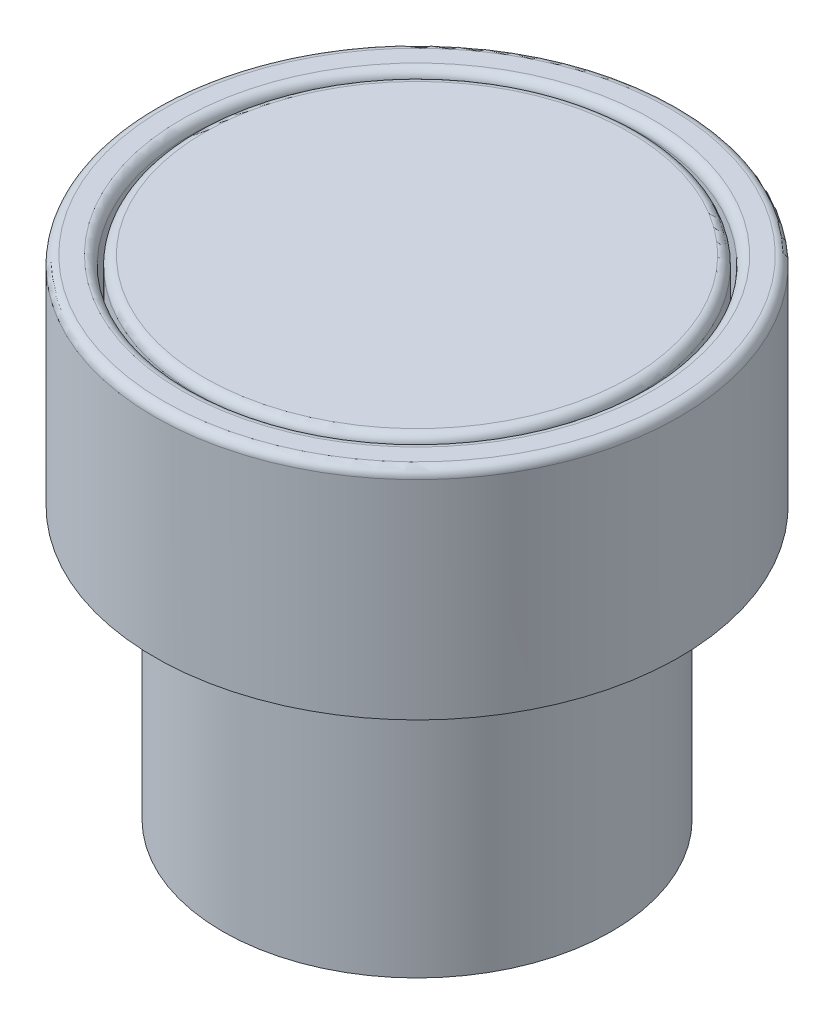
ISO-10303-21;
HEADER;
FILE_DESCRIPTION(('STEP AP214'),'2;1');
FILE_NAME('part.step','',(''),(''),'','','');
FILE_SCHEMA(('AUTOMOTIVE_DESIGN { 1 0 10303 214 1 1 1 1 }'));
ENDSEC;
DATA;
#1=APPLICATION_CONTEXT('core data for automotive mechanical design processes');
#2=APPLICATION_PROTOCOL_DEFINITION('international standard','automotive_design',2000,#1);
#3=PRODUCT_CONTEXT('',#1,'mechanical');
#4=PRODUCT('Part','Part','',(#3));
#5=PRODUCT_RELATED_PRODUCT_CATEGORY('part','',(#4));
#6=PRODUCT_DEFINITION_FORMATION('','',#4);
#7=PRODUCT_DEFINITION_CONTEXT('part definition',#1,'design');
#8=PRODUCT_DEFINITION('design','',#6,#7);
#9=PRODUCT_DEFINITION_SHAPE('','',#8);
#10=(LENGTH_UNIT() NAMED_UNIT(*) SI_UNIT(.MILLI.,.METRE.));
#11=(NAMED_UNIT(*) PLANE_ANGLE_UNIT() SI_UNIT($,.RADIAN.));
#12=(NAMED_UNIT(*) SI_UNIT($,.STERADIAN.) SOLID_ANGLE_UNIT());
#13=UNCERTAINTY_MEASURE_WITH_UNIT(LENGTH_MEASURE(1.E-05),#10,'distance_accuracy_value','');
#14=(GEOMETRIC_REPRESENTATION_CONTEXT(3) GLOBAL_UNCERTAINTY_ASSIGNED_CONTEXT((#13)) GLOBAL_UNIT_ASSIGNED_CONTEXT((#10,
#11,#12)) REPRESENTATION_CONTEXT('',''));
#15=CARTESIAN_POINT('',(0.,0.,0.));
#16=DIRECTION('',(0.,0.,1.));
#17=DIRECTION('',(1.,0.,0.));
#18=AXIS2_PLACEMENT_3D('',#15,#16,#17);
#19=CARTESIAN_POINT('',(0.,0.,0.));
#20=DIRECTION('',(0.,-1.,0.));
#21=DIRECTION('',(0.,0.,-1.));
#22=AXIS2_PLACEMENT_3D('',#19,#20,#21);
#23=PLANE('',#22);
#24=CARTESIAN_POINT('',(0.,0.,0.));
#25=DIRECTION('',(0.,1.,0.));
#26=DIRECTION('',(0.,0.,1.));
#27=AXIS2_PLACEMENT_3D('',#24,#25,#26);
#28=CIRCLE('',#27,12.5);
#29=CARTESIAN_POINT('',(0.,0.,12.5));
#30=VERTEX_POINT('',#29);
#31=EDGE_CURVE('E64',#30,#30,#28,.T.);
#32=ORIENTED_EDGE('',*,*,#31,.T.);
#33=EDGE_LOOP('',(#32));
#34=FACE_BOUND('',#33,.T.);
#35=CARTESIAN_POINT('',(0.,0.,0.));
#36=DIRECTION('',(0.,-1.,0.));
#37=DIRECTION('',(0.,0.,-1.));
#38=AXIS2_PLACEMENT_3D('',#35,#36,#37);
#39=CIRCLE('',#38,12.25);
#40=CARTESIAN_POINT('',(0.,0.,-12.25));
#41=VERTEX_POINT('',#40);
#42=EDGE_CURVE('E61',#41,#41,#39,.F.);
#43=ORIENTED_EDGE('',*,*,#42,.F.);
#44=EDGE_LOOP('',(#43));
#45=FACE_BOUND('',#44,.T.);
#46=ADVANCED_FACE('F35',(#34,#45),#23,.F.);
#47=CARTESIAN_POINT('',(0.,-1.,0.));
#48=DIRECTION('',(0.,-1.,0.));
#49=DIRECTION('',(0.,0.,-1.));
#50=AXIS2_PLACEMENT_3D('',#47,#48,#49);
#51=PLANE('',#50);
#52=CARTESIAN_POINT('',(0.,-1.,0.));
#53=DIRECTION('',(0.,-1.,0.));
#54=DIRECTION('',(0.,0.,-1.));
#55=AXIS2_PLACEMENT_3D('',#52,#53,#54);
#56=CIRCLE('',#55,14.5);
#57=CARTESIAN_POINT('',(0.,-1.,-14.5));
#58=VERTEX_POINT('',#57);
#59=EDGE_CURVE('E67',#58,#58,#56,.T.);
#60=ORIENTED_EDGE('',*,*,#59,.T.);
#61=EDGE_LOOP('',(#60));
#62=FACE_BOUND('',#61,.T.);
#63=CARTESIAN_POINT('',(0.,-1.,0.));
#64=DIRECTION('',(0.,-1.,0.));
#65=DIRECTION('',(0.,0.,-1.));
#66=AXIS2_PLACEMENT_3D('',#63,#64,#65);
#67=CIRCLE('',#66,10.75);
#68=CARTESIAN_POINT('',(0.,-1.,-10.75));
#69=VERTEX_POINT('',#68);
#70=EDGE_CURVE('E71',#69,#69,#67,.T.);
#71=ORIENTED_EDGE('',*,*,#70,.F.);
#72=EDGE_LOOP('',(#71));
#73=FACE_BOUND('',#72,.T.);
#74=ADVANCED_FACE('F86',(#62,#73),#51,.T.);
#75=CARTESIAN_POINT('',(0.,11.,0.));
#76=DIRECTION('',(0.,1.,0.));
#77=DIRECTION('',(0.,0.,1.));
#78=AXIS2_PLACEMENT_3D('',#75,#76,#77);
#79=PLANE('',#78);
#80=CARTESIAN_POINT('',(0.,11.,0.));
#81=DIRECTION('',(0.,1.,0.));
#82=DIRECTION('',(0.,0.,1.));
#83=AXIS2_PLACEMENT_3D('',#80,#81,#82);
#84=CIRCLE('',#83,14.);
#85=CARTESIAN_POINT('',(0.,11.,14.));
#86=VERTEX_POINT('',#85);
#87=EDGE_CURVE('E46',#86,#86,#84,.T.);
#88=ORIENTED_EDGE('',*,*,#87,.T.);
#89=EDGE_LOOP('',(#88));
#90=FACE_BOUND('',#89,.T.);
#91=CARTESIAN_POINT('',(0.,11.,0.));
#92=DIRECTION('',(0.,1.,0.));
#93=DIRECTION('',(0.,0.,1.));
#94=AXIS2_PLACEMENT_3D('',#91,#92,#93);
#95=CIRCLE('',#94,13.);
#96=CARTESIAN_POINT('',(0.,11.,13.));
#97=VERTEX_POINT('',#96);
#98=EDGE_CURVE('E50',#97,#97,#95,.F.);
#99=ORIENTED_EDGE('',*,*,#98,.T.);
#100=EDGE_LOOP('',(#99));
#101=FACE_BOUND('',#100,.T.);
#102=ADVANCED_FACE('F88',(#90,#101),#79,.T.);
#103=CARTESIAN_POINT('',(0.,11.,0.));
#104=DIRECTION('',(0.,-1.,0.));
#105=DIRECTION('',(0.,0.,-1.));
#106=AXIS2_PLACEMENT_3D('',#103,#104,#105);
#107=CYLINDRICAL_SURFACE('',#106,14.5);
#108=CARTESIAN_POINT('',(0.,10.5,0.));
#109=DIRECTION('',(0.,1.,0.));
#110=DIRECTION('',(0.,0.,1.));
#111=AXIS2_PLACEMENT_3D('',#108,#109,#110);
#112=CIRCLE('',#111,14.5);
#113=CARTESIAN_POINT('',(0.,10.5,14.5));
#114=VERTEX_POINT('',#113);
#115=EDGE_CURVE('E42',#114,#114,#112,.F.);
#116=ORIENTED_EDGE('',*,*,#115,.T.);
#117=EDGE_LOOP('',(#116));
#118=FACE_BOUND('',#117,.T.);
#119=ORIENTED_EDGE('',*,*,#59,.F.);
#120=EDGE_LOOP('',(#119));
#121=FACE_BOUND('',#120,.T.);
#122=ADVANCED_FACE('F95',(#118,#121),#107,.T.);
#123=CARTESIAN_POINT('',(0.,11.,0.));
#124=DIRECTION('',(0.,-1.,0.));
#125=DIRECTION('',(0.,0.,-1.));
#126=AXIS2_PLACEMENT_3D('',#123,#124,#125);
#127=CYLINDRICAL_SURFACE('',#126,12.5);
#128=CARTESIAN_POINT('',(0.,10.5,0.));
#129=DIRECTION('',(0.,1.,0.));
#130=DIRECTION('',(0.,0.,1.));
#131=AXIS2_PLACEMENT_3D('',#128,#129,#130);
#132=CIRCLE('',#131,12.5);
#133=CARTESIAN_POINT('',(0.,10.5,12.5));
#134=VERTEX_POINT('',#133);
#135=EDGE_CURVE('E10',#134,#134,#132,.T.);
#136=ORIENTED_EDGE('',*,*,#135,.T.);
#137=EDGE_LOOP('',(#136));
#138=FACE_BOUND('',#137,.T.);
#139=ORIENTED_EDGE('',*,*,#31,.F.);
#140=EDGE_LOOP('',(#139));
#141=FACE_BOUND('',#140,.T.);
#142=ADVANCED_FACE('F82',(#138,#141),#127,.F.);
#143=CARTESIAN_POINT('',(0.,-16.,0.));
#144=DIRECTION('',(0.,1.,0.));
#145=DIRECTION('',(0.,0.,1.));
#146=AXIS2_PLACEMENT_3D('',#143,#144,#145);
#147=CYLINDRICAL_SURFACE('',#146,10.75);
#148=CARTESIAN_POINT('',(0.,-16.,0.));
#149=DIRECTION('',(0.,-1.,0.));
#150=DIRECTION('',(0.,0.,-1.));
#151=AXIS2_PLACEMENT_3D('',#148,#149,#150);
#152=CIRCLE('',#151,10.75);
#153=CARTESIAN_POINT('',(0.,-16.,-10.75));
#154=VERTEX_POINT('',#153);
#155=EDGE_CURVE('E70',#154,#154,#152,.T.);
#156=ORIENTED_EDGE('',*,*,#155,.F.);
#157=EDGE_LOOP('',(#156));
#158=FACE_BOUND('',#157,.T.);
#159=ORIENTED_EDGE('',*,*,#70,.T.);
#160=EDGE_LOOP('',(#159));
#161=FACE_BOUND('',#160,.T.);
#162=ADVANCED_FACE('F79',(#158,#161),#147,.T.);
#163=CARTESIAN_POINT('',(0.,-16.,0.));
#164=DIRECTION('',(0.,-1.,0.));
#165=DIRECTION('',(0.,0.,-1.));
#166=AXIS2_PLACEMENT_3D('',#163,#164,#165);
#167=PLANE('',#166);
#168=ORIENTED_EDGE('',*,*,#155,.T.);
#169=EDGE_LOOP('',(#168));
#170=FACE_BOUND('',#169,.T.);
#171=ADVANCED_FACE('F77',(#170),#167,.T.);
#172=CARTESIAN_POINT('',(0.,45.6482322781408,0.));
#173=DIRECTION('',(0.,-1.,0.));
#174=DIRECTION('',(0.,0.,-1.));
#175=AXIS2_PLACEMENT_3D('',#172,#173,#174);
#176=CYLINDRICAL_SURFACE('',#175,12.25);
#177=CARTESIAN_POINT('',(0.,10.5,0.));
#178=DIRECTION('',(0.,1.,0.));
#179=DIRECTION('',(0.,0.,1.));
#180=AXIS2_PLACEMENT_3D('',#177,#178,#179);
#181=CIRCLE('',#180,12.25);
#182=CARTESIAN_POINT('',(0.,10.5,12.25));
#183=VERTEX_POINT('',#182);
#184=EDGE_CURVE('E55',#183,#183,#181,.F.);
#185=ORIENTED_EDGE('',*,*,#184,.T.);
#186=EDGE_LOOP('',(#185));
#187=FACE_BOUND('',#186,.T.);
#188=ORIENTED_EDGE('',*,*,#42,.T.);
#189=EDGE_LOOP('',(#188));
#190=FACE_BOUND('',#189,.T.);
#191=ADVANCED_FACE('F144',(#187,#190),#176,.T.);
#192=CARTESIAN_POINT('',(0.,11.,0.));
#193=DIRECTION('',(0.,1.,0.));
#194=DIRECTION('',(0.,0.,1.));
#195=AXIS2_PLACEMENT_3D('',#192,#193,#194);
#196=PLANE('',#195);
#197=CARTESIAN_POINT('',(0.,11.,0.));
#198=DIRECTION('',(0.,1.,0.));
#199=DIRECTION('',(0.,0.,1.));
#200=AXIS2_PLACEMENT_3D('',#197,#198,#199);
#201=CIRCLE('',#200,11.75);
#202=CARTESIAN_POINT('',(0.,11.,11.75));
#203=VERTEX_POINT('',#202);
#204=EDGE_CURVE('E58',#203,#203,#201,.T.);
#205=ORIENTED_EDGE('',*,*,#204,.T.);
#206=EDGE_LOOP('',(#205));
#207=FACE_BOUND('',#206,.T.);
#208=ADVANCED_FACE('F109',(#207),#196,.T.);
#209=CARTESIAN_POINT('',(0.,10.5,0.));
#210=DIRECTION('',(0.,1.,0.));
#211=DIRECTION('',(0.,0.,1.));
#212=AXIS2_PLACEMENT_3D('',#209,#210,#211);
#213=TOROIDAL_SURFACE('',#212,11.75,0.5);
#214=ORIENTED_EDGE('',*,*,#184,.F.);
#215=EDGE_LOOP('',(#214));
#216=FACE_BOUND('',#215,.T.);
#217=ORIENTED_EDGE('',*,*,#204,.F.);
#218=EDGE_LOOP('',(#217));
#219=FACE_BOUND('',#218,.T.);
#220=ADVANCED_FACE('F106',(#216,#219),#213,.T.);
#221=CARTESIAN_POINT('',(0.,10.5,0.));
#222=DIRECTION('',(0.,1.,0.));
#223=DIRECTION('',(0.,0.,1.));
#224=AXIS2_PLACEMENT_3D('',#221,#222,#223);
#225=TOROIDAL_SURFACE('',#224,14.,0.5);
#226=ORIENTED_EDGE('',*,*,#115,.F.);
#227=EDGE_LOOP('',(#226));
#228=FACE_BOUND('',#227,.T.);
#229=ORIENTED_EDGE('',*,*,#87,.F.);
#230=EDGE_LOOP('',(#229));
#231=FACE_BOUND('',#230,.T.);
#232=ADVANCED_FACE('F108',(#228,#231),#225,.T.);
#233=CARTESIAN_POINT('',(0.,10.5,0.));
#234=DIRECTION('',(0.,1.,0.));
#235=DIRECTION('',(0.,0.,1.));
#236=AXIS2_PLACEMENT_3D('',#233,#234,#235);
#237=TOROIDAL_SURFACE('',#236,13.,0.5);
#238=ORIENTED_EDGE('',*,*,#98,.F.);
#239=EDGE_LOOP('',(#238));
#240=FACE_BOUND('',#239,.T.);
#241=ORIENTED_EDGE('',*,*,#135,.F.);
#242=EDGE_LOOP('',(#241));
#243=FACE_BOUND('',#242,.T.);
#244=ADVANCED_FACE('F37',(#240,#243),#237,.T.);
#245=CLOSED_SHELL('',(#46,#74,#102,#122,#142,#162,#171,#191,#208,#220,#232,#244));
#246=MANIFOLD_SOLID_BREP('B2',#245);
#247=ADVANCED_BREP_SHAPE_REPRESENTATION('',(#18,#246),#14);
#248=SHAPE_DEFINITION_REPRESENTATION(#9,#247);
ENDSEC;
END-ISO-10303-21;
